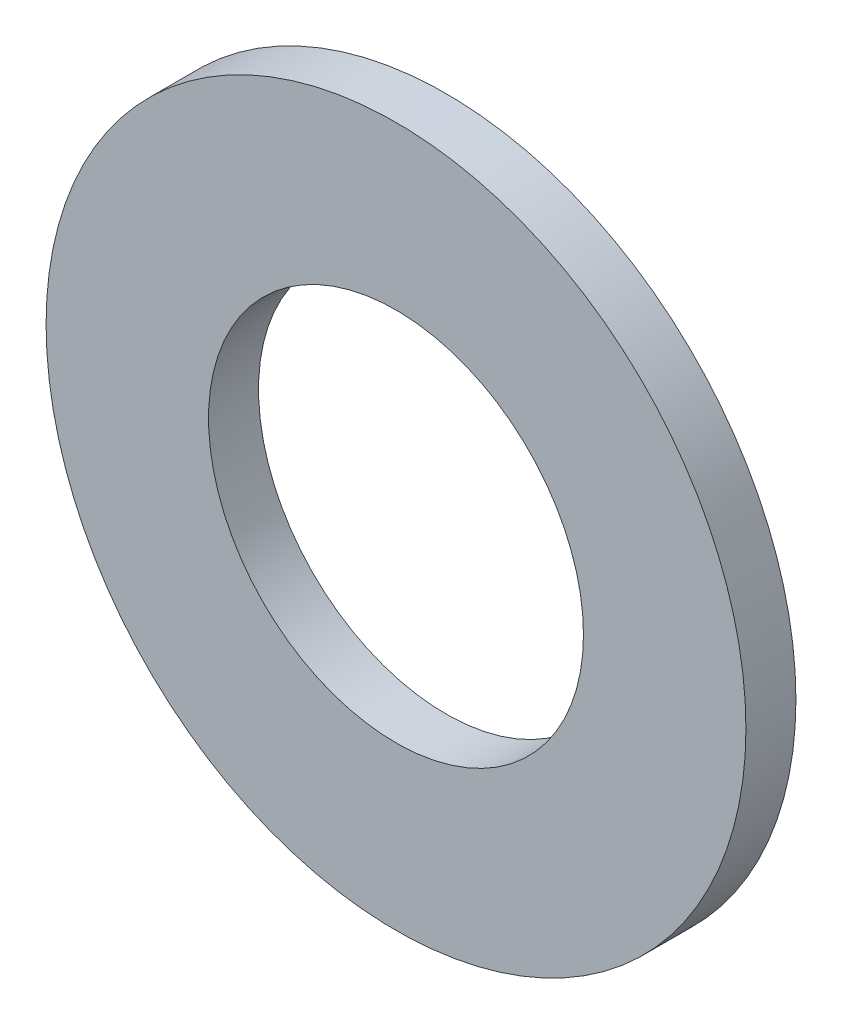
ISO-10303-21;
HEADER;
FILE_DESCRIPTION(('STEP AP214'),'2;1');
FILE_NAME('part.step','',(''),(''),'','','');
FILE_SCHEMA(('AUTOMOTIVE_DESIGN { 1 0 10303 214 1 1 1 1 }'));
ENDSEC;
DATA;
#1=APPLICATION_CONTEXT('core data for automotive mechanical design processes');
#2=APPLICATION_PROTOCOL_DEFINITION('international standard','automotive_design',2000,#1);
#3=PRODUCT_CONTEXT('',#1,'mechanical');
#4=PRODUCT('Part','Part','',(#3));
#5=PRODUCT_RELATED_PRODUCT_CATEGORY('part','',(#4));
#6=PRODUCT_DEFINITION_FORMATION('','',#4);
#7=PRODUCT_DEFINITION_CONTEXT('part definition',#1,'design');
#8=PRODUCT_DEFINITION('design','',#6,#7);
#9=PRODUCT_DEFINITION_SHAPE('','',#8);
#10=(LENGTH_UNIT() NAMED_UNIT(*) SI_UNIT(.MILLI.,.METRE.));
#11=(NAMED_UNIT(*) PLANE_ANGLE_UNIT() SI_UNIT($,.RADIAN.));
#12=(NAMED_UNIT(*) SI_UNIT($,.STERADIAN.) SOLID_ANGLE_UNIT());
#13=UNCERTAINTY_MEASURE_WITH_UNIT(LENGTH_MEASURE(1.E-05),#10,'distance_accuracy_value','');
#14=(GEOMETRIC_REPRESENTATION_CONTEXT(3) GLOBAL_UNCERTAINTY_ASSIGNED_CONTEXT((#13)) GLOBAL_UNIT_ASSIGNED_CONTEXT((#10,
#11,#12)) REPRESENTATION_CONTEXT('',''));
#15=CARTESIAN_POINT('',(0.,0.,0.));
#16=DIRECTION('',(0.,0.,1.));
#17=DIRECTION('',(1.,0.,0.));
#18=AXIS2_PLACEMENT_3D('',#15,#16,#17);
#19=CARTESIAN_POINT('',(0.,0.,2.));
#20=DIRECTION('',(0.,0.,1.));
#21=DIRECTION('',(1.,0.,0.));
#22=AXIS2_PLACEMENT_3D('',#19,#20,#21);
#23=PLANE('',#22);
#24=CARTESIAN_POINT('',(0.,0.,2.));
#25=DIRECTION('',(0.,0.,1.));
#26=DIRECTION('',(1.,0.,0.));
#27=AXIS2_PLACEMENT_3D('',#24,#25,#26);
#28=CIRCLE('',#27,14.);
#29=CARTESIAN_POINT('',(14.,0.,2.));
#30=VERTEX_POINT('',#29);
#31=EDGE_CURVE('E10',#30,#30,#28,.T.);
#32=ORIENTED_EDGE('',*,*,#31,.T.);
#33=EDGE_LOOP('',(#32));
#34=FACE_BOUND('',#33,.T.);
#35=CARTESIAN_POINT('',(0.,0.,2.));
#36=DIRECTION('',(0.,0.,1.));
#37=DIRECTION('',(1.,0.,0.));
#38=AXIS2_PLACEMENT_3D('',#35,#36,#37);
#39=CIRCLE('',#38,7.5);
#40=CARTESIAN_POINT('',(7.5,0.,2.));
#41=VERTEX_POINT('',#40);
#42=EDGE_CURVE('E54',#41,#41,#39,.T.);
#43=ORIENTED_EDGE('',*,*,#42,.F.);
#44=EDGE_LOOP('',(#43));
#45=FACE_BOUND('',#44,.T.);
#46=ADVANCED_FACE('F41',(#34,#45),#23,.T.);
#47=CARTESIAN_POINT('',(0.,0.,0.));
#48=DIRECTION('',(0.,0.,1.));
#49=DIRECTION('',(1.,0.,0.));
#50=AXIS2_PLACEMENT_3D('',#47,#48,#49);
#51=PLANE('',#50);
#52=CARTESIAN_POINT('',(0.,0.,0.));
#53=DIRECTION('',(0.,0.,1.));
#54=DIRECTION('',(1.,0.,0.));
#55=AXIS2_PLACEMENT_3D('',#52,#53,#54);
#56=CIRCLE('',#55,14.);
#57=CARTESIAN_POINT('',(14.,0.,0.));
#58=VERTEX_POINT('',#57);
#59=EDGE_CURVE('E45',#58,#58,#56,.T.);
#60=ORIENTED_EDGE('',*,*,#59,.F.);
#61=EDGE_LOOP('',(#60));
#62=FACE_BOUND('',#61,.T.);
#63=CARTESIAN_POINT('',(0.,0.,0.));
#64=DIRECTION('',(0.,0.,1.));
#65=DIRECTION('',(1.,0.,0.));
#66=AXIS2_PLACEMENT_3D('',#63,#64,#65);
#67=CIRCLE('',#66,7.5);
#68=CARTESIAN_POINT('',(7.5,0.,0.));
#69=VERTEX_POINT('',#68);
#70=EDGE_CURVE('E56',#69,#69,#67,.T.);
#71=ORIENTED_EDGE('',*,*,#70,.T.);
#72=EDGE_LOOP('',(#71));
#73=FACE_BOUND('',#72,.T.);
#74=ADVANCED_FACE('F68',(#62,#73),#51,.F.);
#75=CARTESIAN_POINT('',(0.,0.,2.));
#76=DIRECTION('',(0.,0.,-1.));
#77=DIRECTION('',(-1.,0.,0.));
#78=AXIS2_PLACEMENT_3D('',#75,#76,#77);
#79=CYLINDRICAL_SURFACE('',#78,14.);
#80=ORIENTED_EDGE('',*,*,#31,.F.);
#81=EDGE_LOOP('',(#80));
#82=FACE_BOUND('',#81,.T.);
#83=ORIENTED_EDGE('',*,*,#59,.T.);
#84=EDGE_LOOP('',(#83));
#85=FACE_BOUND('',#84,.T.);
#86=ADVANCED_FACE('F43',(#82,#85),#79,.T.);
#87=CARTESIAN_POINT('',(0.,0.,2.));
#88=DIRECTION('',(0.,0.,-1.));
#89=DIRECTION('',(-1.,0.,0.));
#90=AXIS2_PLACEMENT_3D('',#87,#88,#89);
#91=CYLINDRICAL_SURFACE('',#90,7.5);
#92=ORIENTED_EDGE('',*,*,#42,.T.);
#93=EDGE_LOOP('',(#92));
#94=FACE_BOUND('',#93,.T.);
#95=ORIENTED_EDGE('',*,*,#70,.F.);
#96=EDGE_LOOP('',(#95));
#97=FACE_BOUND('',#96,.T.);
#98=ADVANCED_FACE('F64',(#94,#97),#91,.F.);
#99=CLOSED_SHELL('',(#46,#74,#86,#98));
#100=MANIFOLD_SOLID_BREP('B2',#99);
#101=ADVANCED_BREP_SHAPE_REPRESENTATION('',(#18,#100),#14);
#102=SHAPE_DEFINITION_REPRESENTATION(#9,#101);
ENDSEC;
END-ISO-10303-21;
